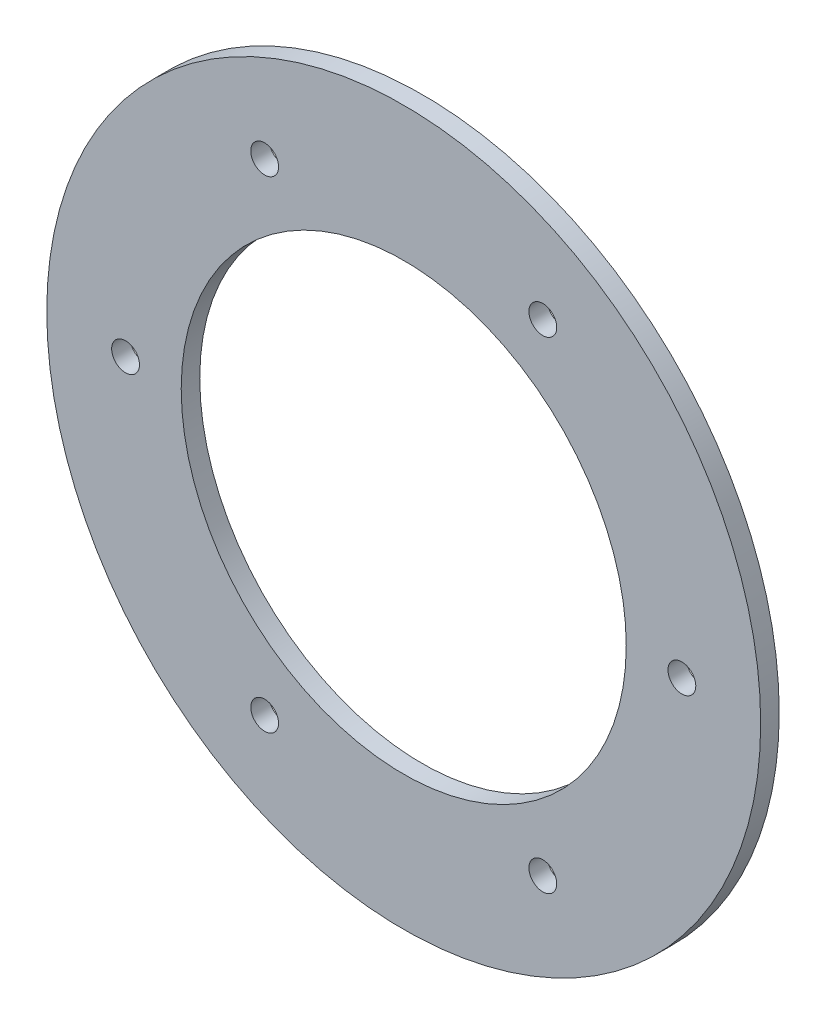
ISO-10303-21;
HEADER;
FILE_DESCRIPTION(('STEP AP214'),'2;1');
FILE_NAME('part.step','',(''),(''),'','','');
FILE_SCHEMA(('AUTOMOTIVE_DESIGN { 1 0 10303 214 1 1 1 1 }'));
ENDSEC;
DATA;
#1=APPLICATION_CONTEXT('core data for automotive mechanical design processes');
#2=APPLICATION_PROTOCOL_DEFINITION('international standard','automotive_design',2000,#1);
#3=PRODUCT_CONTEXT('',#1,'mechanical');
#4=PRODUCT('Part','Part','',(#3));
#5=PRODUCT_RELATED_PRODUCT_CATEGORY('part','',(#4));
#6=PRODUCT_DEFINITION_FORMATION('','',#4);
#7=PRODUCT_DEFINITION_CONTEXT('part definition',#1,'design');
#8=PRODUCT_DEFINITION('design','',#6,#7);
#9=PRODUCT_DEFINITION_SHAPE('','',#8);
#10=(LENGTH_UNIT() NAMED_UNIT(*) SI_UNIT(.MILLI.,.METRE.));
#11=(NAMED_UNIT(*) PLANE_ANGLE_UNIT() SI_UNIT($,.RADIAN.));
#12=(NAMED_UNIT(*) SI_UNIT($,.STERADIAN.) SOLID_ANGLE_UNIT());
#13=UNCERTAINTY_MEASURE_WITH_UNIT(LENGTH_MEASURE(1.E-05),#10,'distance_accuracy_value','');
#14=(GEOMETRIC_REPRESENTATION_CONTEXT(3) GLOBAL_UNCERTAINTY_ASSIGNED_CONTEXT((#13)) GLOBAL_UNIT_ASSIGNED_CONTEXT((#10,
#11,#12)) REPRESENTATION_CONTEXT('',''));
#15=CARTESIAN_POINT('',(0.,0.,0.));
#16=DIRECTION('',(0.,0.,1.));
#17=DIRECTION('',(1.,0.,0.));
#18=AXIS2_PLACEMENT_3D('',#15,#16,#17);
#19=CARTESIAN_POINT('',(0.,0.,2.));
#20=DIRECTION('',(0.,0.,1.));
#21=DIRECTION('',(1.,0.,0.));
#22=AXIS2_PLACEMENT_3D('',#19,#20,#21);
#23=PLANE('',#22);
#24=CARTESIAN_POINT('',(30.0000000000007,-4.44089209850063E-13,2.));
#25=DIRECTION('',(0.,0.,1.));
#26=DIRECTION('',(1.,0.,0.));
#27=AXIS2_PLACEMENT_3D('',#24,#25,#26);
#28=CIRCLE('',#27,1.50000000000006);
#29=CARTESIAN_POINT('',(31.5000000000007,-4.44089209850063E-13,2.));
#30=VERTEX_POINT('',#29);
#31=EDGE_CURVE('E70',#30,#30,#28,.T.);
#32=ORIENTED_EDGE('',*,*,#31,.F.);
#33=EDGE_LOOP('',(#32));
#34=FACE_BOUND('',#33,.T.);
#35=CARTESIAN_POINT('',(-14.9999999999948,25.9807621135328,2.));
#36=DIRECTION('',(0.,0.,1.));
#37=DIRECTION('',(1.,0.,0.));
#38=AXIS2_PLACEMENT_3D('',#35,#36,#37);
#39=CIRCLE('',#38,1.49999999999496);
#40=CARTESIAN_POINT('',(-13.4999999999998,25.9807621135328,2.));
#41=VERTEX_POINT('',#40);
#42=EDGE_CURVE('E58',#41,#41,#39,.T.);
#43=ORIENTED_EDGE('',*,*,#42,.F.);
#44=EDGE_LOOP('',(#43));
#45=FACE_BOUND('',#44,.T.);
#46=CARTESIAN_POINT('',(-14.9999999999948,-25.9807621135364,2.));
#47=DIRECTION('',(0.,0.,1.));
#48=DIRECTION('',(1.,0.,0.));
#49=AXIS2_PLACEMENT_3D('',#46,#47,#48);
#50=CIRCLE('',#49,1.50000000000006);
#51=CARTESIAN_POINT('',(-13.4999999999947,-25.9807621135364,2.));
#52=VERTEX_POINT('',#51);
#53=EDGE_CURVE('E46',#52,#52,#50,.T.);
#54=ORIENTED_EDGE('',*,*,#53,.F.);
#55=EDGE_LOOP('',(#54));
#56=FACE_BOUND('',#55,.T.);
#57=CARTESIAN_POINT('',(0.,0.,2.));
#58=DIRECTION('',(0.,0.,1.));
#59=DIRECTION('',(1.,0.,0.));
#60=AXIS2_PLACEMENT_3D('',#57,#58,#59);
#61=CIRCLE('',#60,38.5);
#62=CARTESIAN_POINT('',(38.5,0.,2.));
#63=VERTEX_POINT('',#62);
#64=EDGE_CURVE('E10',#63,#63,#61,.T.);
#65=ORIENTED_EDGE('',*,*,#64,.T.);
#66=EDGE_LOOP('',(#65));
#67=FACE_BOUND('',#66,.T.);
#68=CARTESIAN_POINT('',(-30.0000000000002,-4.44089209850063E-13,2.));
#69=DIRECTION('',(0.,0.,1.));
#70=DIRECTION('',(1.,0.,0.));
#71=AXIS2_PLACEMENT_3D('',#68,#69,#70);
#72=CIRCLE('',#71,1.50000000000006);
#73=CARTESIAN_POINT('',(-28.5000000000002,-4.44089209850063E-13,2.));
#74=VERTEX_POINT('',#73);
#75=EDGE_CURVE('E41',#74,#74,#72,.T.);
#76=ORIENTED_EDGE('',*,*,#75,.F.);
#77=EDGE_LOOP('',(#76));
#78=FACE_BOUND('',#77,.T.);
#79=CARTESIAN_POINT('',(15.0000000000001,25.9807621135328,2.));
#80=DIRECTION('',(0.,0.,1.));
#81=DIRECTION('',(1.,0.,0.));
#82=AXIS2_PLACEMENT_3D('',#79,#80,#81);
#83=CIRCLE('',#82,1.49999999999659);
#84=CARTESIAN_POINT('',(16.4999999999967,25.9807621135328,2.));
#85=VERTEX_POINT('',#84);
#86=EDGE_CURVE('E52',#85,#85,#83,.T.);
#87=ORIENTED_EDGE('',*,*,#86,.F.);
#88=EDGE_LOOP('',(#87));
#89=FACE_BOUND('',#88,.T.);
#90=CARTESIAN_POINT('',(15.0000000000001,-25.9807621135364,2.));
#91=DIRECTION('',(0.,0.,1.));
#92=DIRECTION('',(1.,0.,0.));
#93=AXIS2_PLACEMENT_3D('',#90,#91,#92);
#94=CIRCLE('',#93,1.50000000000097);
#95=CARTESIAN_POINT('',(16.5000000000011,-25.9807621135364,2.));
#96=VERTEX_POINT('',#95);
#97=EDGE_CURVE('E64',#96,#96,#94,.T.);
#98=ORIENTED_EDGE('',*,*,#97,.F.);
#99=EDGE_LOOP('',(#98));
#100=FACE_BOUND('',#99,.T.);
#101=CARTESIAN_POINT('',(0.,0.,2.));
#102=DIRECTION('',(0.,0.,1.));
#103=DIRECTION('',(1.,0.,0.));
#104=AXIS2_PLACEMENT_3D('',#101,#102,#103);
#105=CIRCLE('',#104,24.);
#106=CARTESIAN_POINT('',(24.,0.,2.));
#107=VERTEX_POINT('',#106);
#108=EDGE_CURVE('E76',#107,#107,#105,.T.);
#109=ORIENTED_EDGE('',*,*,#108,.F.);
#110=EDGE_LOOP('',(#109));
#111=FACE_BOUND('',#110,.T.);
#112=ADVANCED_FACE('F30',(#34,#45,#56,#67,#78,#89,#100,#111),#23,.T.);
#113=CARTESIAN_POINT('',(0.,0.,0.));
#114=DIRECTION('',(0.,0.,1.));
#115=DIRECTION('',(1.,0.,0.));
#116=AXIS2_PLACEMENT_3D('',#113,#114,#115);
#117=PLANE('',#116);
#118=CARTESIAN_POINT('',(30.0000000000007,-4.44089209850063E-13,0.));
#119=DIRECTION('',(0.,0.,1.));
#120=DIRECTION('',(1.,0.,0.));
#121=AXIS2_PLACEMENT_3D('',#118,#119,#120);
#122=CIRCLE('',#121,1.50000000000006);
#123=CARTESIAN_POINT('',(31.5000000000007,-4.44089209850063E-13,0.));
#124=VERTEX_POINT('',#123);
#125=EDGE_CURVE('E73',#124,#124,#122,.T.);
#126=ORIENTED_EDGE('',*,*,#125,.T.);
#127=EDGE_LOOP('',(#126));
#128=FACE_BOUND('',#127,.T.);
#129=CARTESIAN_POINT('',(-14.9999999999948,25.9807621135328,0.));
#130=DIRECTION('',(0.,0.,1.));
#131=DIRECTION('',(1.,0.,0.));
#132=AXIS2_PLACEMENT_3D('',#129,#130,#131);
#133=CIRCLE('',#132,1.49999999999496);
#134=CARTESIAN_POINT('',(-13.4999999999998,25.9807621135328,0.));
#135=VERTEX_POINT('',#134);
#136=EDGE_CURVE('E61',#135,#135,#133,.T.);
#137=ORIENTED_EDGE('',*,*,#136,.T.);
#138=EDGE_LOOP('',(#137));
#139=FACE_BOUND('',#138,.T.);
#140=CARTESIAN_POINT('',(-14.9999999999948,-25.9807621135364,0.));
#141=DIRECTION('',(0.,0.,1.));
#142=DIRECTION('',(1.,0.,0.));
#143=AXIS2_PLACEMENT_3D('',#140,#141,#142);
#144=CIRCLE('',#143,1.50000000000006);
#145=CARTESIAN_POINT('',(-13.4999999999947,-25.9807621135364,0.));
#146=VERTEX_POINT('',#145);
#147=EDGE_CURVE('E49',#146,#146,#144,.T.);
#148=ORIENTED_EDGE('',*,*,#147,.T.);
#149=EDGE_LOOP('',(#148));
#150=FACE_BOUND('',#149,.T.);
#151=CARTESIAN_POINT('',(0.,0.,0.));
#152=DIRECTION('',(0.,0.,1.));
#153=DIRECTION('',(1.,0.,0.));
#154=AXIS2_PLACEMENT_3D('',#151,#152,#153);
#155=CIRCLE('',#154,38.5);
#156=CARTESIAN_POINT('',(38.5,0.,0.));
#157=VERTEX_POINT('',#156);
#158=EDGE_CURVE('E34',#157,#157,#155,.T.);
#159=ORIENTED_EDGE('',*,*,#158,.F.);
#160=EDGE_LOOP('',(#159));
#161=FACE_BOUND('',#160,.T.);
#162=CARTESIAN_POINT('',(-30.0000000000002,-4.44089209850063E-13,0.));
#163=DIRECTION('',(0.,0.,1.));
#164=DIRECTION('',(1.,0.,0.));
#165=AXIS2_PLACEMENT_3D('',#162,#163,#164);
#166=CIRCLE('',#165,1.50000000000006);
#167=CARTESIAN_POINT('',(-28.5000000000002,-4.44089209850063E-13,0.));
#168=VERTEX_POINT('',#167);
#169=EDGE_CURVE('E43',#168,#168,#166,.T.);
#170=ORIENTED_EDGE('',*,*,#169,.T.);
#171=EDGE_LOOP('',(#170));
#172=FACE_BOUND('',#171,.T.);
#173=CARTESIAN_POINT('',(15.0000000000001,25.9807621135328,0.));
#174=DIRECTION('',(0.,0.,1.));
#175=DIRECTION('',(1.,0.,0.));
#176=AXIS2_PLACEMENT_3D('',#173,#174,#175);
#177=CIRCLE('',#176,1.49999999999659);
#178=CARTESIAN_POINT('',(16.4999999999967,25.9807621135328,0.));
#179=VERTEX_POINT('',#178);
#180=EDGE_CURVE('E55',#179,#179,#177,.T.);
#181=ORIENTED_EDGE('',*,*,#180,.T.);
#182=EDGE_LOOP('',(#181));
#183=FACE_BOUND('',#182,.T.);
#184=CARTESIAN_POINT('',(15.0000000000001,-25.9807621135364,0.));
#185=DIRECTION('',(0.,0.,1.));
#186=DIRECTION('',(1.,0.,0.));
#187=AXIS2_PLACEMENT_3D('',#184,#185,#186);
#188=CIRCLE('',#187,1.50000000000097);
#189=CARTESIAN_POINT('',(16.5000000000011,-25.9807621135364,0.));
#190=VERTEX_POINT('',#189);
#191=EDGE_CURVE('E67',#190,#190,#188,.T.);
#192=ORIENTED_EDGE('',*,*,#191,.T.);
#193=EDGE_LOOP('',(#192));
#194=FACE_BOUND('',#193,.T.);
#195=CARTESIAN_POINT('',(0.,0.,0.));
#196=DIRECTION('',(0.,0.,1.));
#197=DIRECTION('',(1.,0.,0.));
#198=AXIS2_PLACEMENT_3D('',#195,#196,#197);
#199=CIRCLE('',#198,24.);
#200=CARTESIAN_POINT('',(24.,0.,0.));
#201=VERTEX_POINT('',#200);
#202=EDGE_CURVE('E79',#201,#201,#199,.T.);
#203=ORIENTED_EDGE('',*,*,#202,.T.);
#204=EDGE_LOOP('',(#203));
#205=FACE_BOUND('',#204,.T.);
#206=ADVANCED_FACE('F89',(#128,#139,#150,#161,#172,#183,#194,#205),#117,.F.);
#207=CARTESIAN_POINT('',(0.,0.,2.));
#208=DIRECTION('',(0.,0.,-1.));
#209=DIRECTION('',(-1.,0.,0.));
#210=AXIS2_PLACEMENT_3D('',#207,#208,#209);
#211=CYLINDRICAL_SURFACE('',#210,38.5);
#212=ORIENTED_EDGE('',*,*,#64,.F.);
#213=EDGE_LOOP('',(#212));
#214=FACE_BOUND('',#213,.T.);
#215=ORIENTED_EDGE('',*,*,#158,.T.);
#216=EDGE_LOOP('',(#215));
#217=FACE_BOUND('',#216,.T.);
#218=ADVANCED_FACE('F32',(#214,#217),#211,.T.);
#219=CARTESIAN_POINT('',(-30.0000000000002,-4.44089209850063E-13,2.));
#220=DIRECTION('',(0.,0.,-1.));
#221=DIRECTION('',(-1.,0.,0.));
#222=AXIS2_PLACEMENT_3D('',#219,#220,#221);
#223=CYLINDRICAL_SURFACE('',#222,1.50000000000006);
#224=ORIENTED_EDGE('',*,*,#75,.T.);
#225=EDGE_LOOP('',(#224));
#226=FACE_BOUND('',#225,.T.);
#227=ORIENTED_EDGE('',*,*,#169,.F.);
#228=EDGE_LOOP('',(#227));
#229=FACE_BOUND('',#228,.T.);
#230=ADVANCED_FACE('F99',(#226,#229),#223,.F.);
#231=CARTESIAN_POINT('',(-14.9999999999948,-25.9807621135364,2.));
#232=DIRECTION('',(0.,0.,-1.));
#233=DIRECTION('',(-1.,0.,0.));
#234=AXIS2_PLACEMENT_3D('',#231,#232,#233);
#235=CYLINDRICAL_SURFACE('',#234,1.50000000000006);
#236=ORIENTED_EDGE('',*,*,#53,.T.);
#237=EDGE_LOOP('',(#236));
#238=FACE_BOUND('',#237,.T.);
#239=ORIENTED_EDGE('',*,*,#147,.F.);
#240=EDGE_LOOP('',(#239));
#241=FACE_BOUND('',#240,.T.);
#242=ADVANCED_FACE('F102',(#238,#241),#235,.F.);
#243=CARTESIAN_POINT('',(15.0000000000001,25.9807621135328,2.));
#244=DIRECTION('',(0.,0.,-1.));
#245=DIRECTION('',(-1.,0.,0.));
#246=AXIS2_PLACEMENT_3D('',#243,#244,#245);
#247=CYLINDRICAL_SURFACE('',#246,1.49999999999659);
#248=ORIENTED_EDGE('',*,*,#86,.T.);
#249=EDGE_LOOP('',(#248));
#250=FACE_BOUND('',#249,.T.);
#251=ORIENTED_EDGE('',*,*,#180,.F.);
#252=EDGE_LOOP('',(#251));
#253=FACE_BOUND('',#252,.T.);
#254=ADVANCED_FACE('F106',(#250,#253),#247,.F.);
#255=CARTESIAN_POINT('',(-14.9999999999948,25.9807621135328,2.));
#256=DIRECTION('',(0.,0.,-1.));
#257=DIRECTION('',(-1.,0.,0.));
#258=AXIS2_PLACEMENT_3D('',#255,#256,#257);
#259=CYLINDRICAL_SURFACE('',#258,1.49999999999496);
#260=ORIENTED_EDGE('',*,*,#42,.T.);
#261=EDGE_LOOP('',(#260));
#262=FACE_BOUND('',#261,.T.);
#263=ORIENTED_EDGE('',*,*,#136,.F.);
#264=EDGE_LOOP('',(#263));
#265=FACE_BOUND('',#264,.T.);
#266=ADVANCED_FACE('F110',(#262,#265),#259,.F.);
#267=CARTESIAN_POINT('',(15.0000000000001,-25.9807621135364,2.));
#268=DIRECTION('',(0.,0.,-1.));
#269=DIRECTION('',(-1.,0.,0.));
#270=AXIS2_PLACEMENT_3D('',#267,#268,#269);
#271=CYLINDRICAL_SURFACE('',#270,1.50000000000097);
#272=ORIENTED_EDGE('',*,*,#97,.T.);
#273=EDGE_LOOP('',(#272));
#274=FACE_BOUND('',#273,.T.);
#275=ORIENTED_EDGE('',*,*,#191,.F.);
#276=EDGE_LOOP('',(#275));
#277=FACE_BOUND('',#276,.T.);
#278=ADVANCED_FACE('F114',(#274,#277),#271,.F.);
#279=CARTESIAN_POINT('',(30.0000000000007,-4.44089209850063E-13,2.));
#280=DIRECTION('',(0.,0.,-1.));
#281=DIRECTION('',(-1.,0.,0.));
#282=AXIS2_PLACEMENT_3D('',#279,#280,#281);
#283=CYLINDRICAL_SURFACE('',#282,1.50000000000006);
#284=ORIENTED_EDGE('',*,*,#31,.T.);
#285=EDGE_LOOP('',(#284));
#286=FACE_BOUND('',#285,.T.);
#287=ORIENTED_EDGE('',*,*,#125,.F.);
#288=EDGE_LOOP('',(#287));
#289=FACE_BOUND('',#288,.T.);
#290=ADVANCED_FACE('F118',(#286,#289),#283,.F.);
#291=CARTESIAN_POINT('',(0.,0.,2.));
#292=DIRECTION('',(0.,0.,-1.));
#293=DIRECTION('',(-1.,0.,0.));
#294=AXIS2_PLACEMENT_3D('',#291,#292,#293);
#295=CYLINDRICAL_SURFACE('',#294,24.);
#296=ORIENTED_EDGE('',*,*,#108,.T.);
#297=EDGE_LOOP('',(#296));
#298=FACE_BOUND('',#297,.T.);
#299=ORIENTED_EDGE('',*,*,#202,.F.);
#300=EDGE_LOOP('',(#299));
#301=FACE_BOUND('',#300,.T.);
#302=ADVANCED_FACE('F85',(#298,#301),#295,.F.);
#303=CLOSED_SHELL('',(#112,#206,#218,#230,#242,#254,#266,#278,#290,#302));
#304=MANIFOLD_SOLID_BREP('B2',#303);
#305=ADVANCED_BREP_SHAPE_REPRESENTATION('',(#18,#304),#14);
#306=SHAPE_DEFINITION_REPRESENTATION(#9,#305);
ENDSEC;
END-ISO-10303-21;
